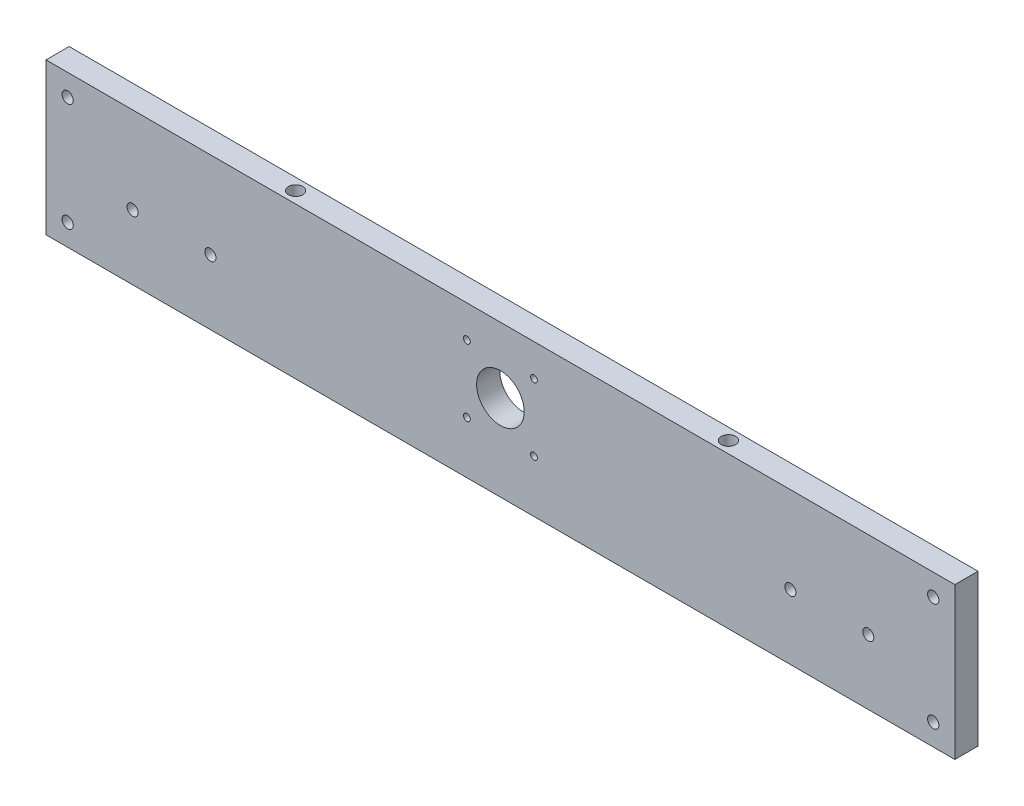
ISO-10303-21;
HEADER;
FILE_DESCRIPTION(('STEP AP214'),'2;1');
FILE_NAME('part.step','',(''),(''),'','','');
FILE_SCHEMA(('AUTOMOTIVE_DESIGN { 1 0 10303 214 1 1 1 1 }'));
ENDSEC;
DATA;
#1=APPLICATION_CONTEXT('core data for automotive mechanical design processes');
#2=APPLICATION_PROTOCOL_DEFINITION('international standard','automotive_design',2000,#1);
#3=PRODUCT_CONTEXT('',#1,'mechanical');
#4=PRODUCT('Part','Part','',(#3));
#5=PRODUCT_RELATED_PRODUCT_CATEGORY('part','',(#4));
#6=PRODUCT_DEFINITION_FORMATION('','',#4);
#7=PRODUCT_DEFINITION_CONTEXT('part definition',#1,'design');
#8=PRODUCT_DEFINITION('design','',#6,#7);
#9=PRODUCT_DEFINITION_SHAPE('','',#8);
#10=(LENGTH_UNIT() NAMED_UNIT(*) SI_UNIT(.MILLI.,.METRE.));
#11=(NAMED_UNIT(*) PLANE_ANGLE_UNIT() SI_UNIT($,.RADIAN.));
#12=(NAMED_UNIT(*) SI_UNIT($,.STERADIAN.) SOLID_ANGLE_UNIT());
#13=UNCERTAINTY_MEASURE_WITH_UNIT(LENGTH_MEASURE(1.E-05),#10,'distance_accuracy_value','');
#14=(GEOMETRIC_REPRESENTATION_CONTEXT(3) GLOBAL_UNCERTAINTY_ASSIGNED_CONTEXT((#13)) GLOBAL_UNIT_ASSIGNED_CONTEXT((#10,
#11,#12)) REPRESENTATION_CONTEXT('',''));
#15=CARTESIAN_POINT('',(0.,0.,0.));
#16=DIRECTION('',(0.,0.,1.));
#17=DIRECTION('',(1.,0.,0.));
#18=AXIS2_PLACEMENT_3D('',#15,#16,#17);
#19=CARTESIAN_POINT('',(-210.,-35.,10.7));
#20=DIRECTION('',(1.,0.,0.));
#21=DIRECTION('',(0.,0.,-1.));
#22=AXIS2_PLACEMENT_3D('',#19,#20,#21);
#23=PLANE('',#22);
#24=DIRECTION('',(0.,-1.,0.));
#25=VECTOR('',#24,1.);
#26=CARTESIAN_POINT('',(-210.,-35.,0.));
#27=LINE('',#26,#25);
#28=CARTESIAN_POINT('',(-210.,35.,0.));
#29=VERTEX_POINT('',#28);
#30=CARTESIAN_POINT('',(-210.,-35.,0.));
#31=VERTEX_POINT('',#30);
#32=EDGE_CURVE('E188',#29,#31,#27,.T.);
#33=ORIENTED_EDGE('',*,*,#32,.T.);
#34=DIRECTION('',(0.,0.,-1.));
#35=VECTOR('',#34,1.);
#36=CARTESIAN_POINT('',(-210.,-35.,10.7));
#37=LINE('',#36,#35);
#38=CARTESIAN_POINT('',(-210.,-35.,10.7));
#39=VERTEX_POINT('',#38);
#40=EDGE_CURVE('E11',#39,#31,#37,.T.);
#41=ORIENTED_EDGE('',*,*,#40,.F.);
#42=DIRECTION('',(0.,-1.,0.));
#43=VECTOR('',#42,1.);
#44=CARTESIAN_POINT('',(-210.,-35.,10.7));
#45=LINE('',#44,#43);
#46=CARTESIAN_POINT('',(-210.,35.,10.7));
#47=VERTEX_POINT('',#46);
#48=EDGE_CURVE('E191',#47,#39,#45,.T.);
#49=ORIENTED_EDGE('',*,*,#48,.F.);
#50=DIRECTION('',(0.,0.,-1.));
#51=VECTOR('',#50,1.);
#52=CARTESIAN_POINT('',(-210.,35.,10.7));
#53=LINE('',#52,#51);
#54=EDGE_CURVE('E197',#47,#29,#53,.T.);
#55=ORIENTED_EDGE('',*,*,#54,.T.);
#56=EDGE_LOOP('',(#33,#41,#49,#55));
#57=FACE_BOUND('',#56,.T.);
#58=ADVANCED_FACE('F37',(#57),#23,.F.);
#59=CARTESIAN_POINT('',(210.,-35.,10.7));
#60=DIRECTION('',(0.,1.,0.));
#61=DIRECTION('',(-1.,0.,0.));
#62=AXIS2_PLACEMENT_3D('',#59,#60,#61);
#63=PLANE('',#62);
#64=DIRECTION('',(1.,0.,0.));
#65=VECTOR('',#64,1.);
#66=CARTESIAN_POINT('',(210.,-35.,0.));
#67=LINE('',#66,#65);
#68=CARTESIAN_POINT('',(210.,-35.,0.));
#69=VERTEX_POINT('',#68);
#70=EDGE_CURVE('E200',#31,#69,#67,.T.);
#71=ORIENTED_EDGE('',*,*,#70,.T.);
#72=DIRECTION('',(0.,0.,-1.));
#73=VECTOR('',#72,1.);
#74=CARTESIAN_POINT('',(210.,-35.,10.7));
#75=LINE('',#74,#73);
#76=CARTESIAN_POINT('',(210.,-35.,10.7));
#77=VERTEX_POINT('',#76);
#78=EDGE_CURVE('E45',#77,#69,#75,.T.);
#79=ORIENTED_EDGE('',*,*,#78,.F.);
#80=DIRECTION('',(1.,0.,0.));
#81=VECTOR('',#80,1.);
#82=CARTESIAN_POINT('',(210.,-35.,10.7));
#83=LINE('',#82,#81);
#84=EDGE_CURVE('E84',#39,#77,#83,.T.);
#85=ORIENTED_EDGE('',*,*,#84,.F.);
#86=ORIENTED_EDGE('',*,*,#40,.T.);
#87=EDGE_LOOP('',(#71,#79,#85,#86));
#88=FACE_BOUND('',#87,.T.);
#89=ADVANCED_FACE('F225',(#88),#63,.F.);
#90=CARTESIAN_POINT('',(210.,-35.,10.7));
#91=DIRECTION('',(-1.,0.,0.));
#92=DIRECTION('',(0.,0.,1.));
#93=AXIS2_PLACEMENT_3D('',#90,#91,#92);
#94=PLANE('',#93);
#95=DIRECTION('',(0.,1.,0.));
#96=VECTOR('',#95,1.);
#97=CARTESIAN_POINT('',(210.,-35.,0.));
#98=LINE('',#97,#96);
#99=CARTESIAN_POINT('',(210.,35.,0.));
#100=VERTEX_POINT('',#99);
#101=EDGE_CURVE('E71',#69,#100,#98,.T.);
#102=ORIENTED_EDGE('',*,*,#101,.T.);
#103=DIRECTION('',(0.,0.,-1.));
#104=VECTOR('',#103,1.);
#105=CARTESIAN_POINT('',(210.,35.,10.7));
#106=LINE('',#105,#104);
#107=CARTESIAN_POINT('',(210.,35.,10.7));
#108=VERTEX_POINT('',#107);
#109=EDGE_CURVE('E205',#108,#100,#106,.T.);
#110=ORIENTED_EDGE('',*,*,#109,.F.);
#111=DIRECTION('',(0.,1.,0.));
#112=VECTOR('',#111,1.);
#113=CARTESIAN_POINT('',(210.,-35.,10.7));
#114=LINE('',#113,#112);
#115=EDGE_CURVE('E194',#77,#108,#114,.T.);
#116=ORIENTED_EDGE('',*,*,#115,.F.);
#117=ORIENTED_EDGE('',*,*,#78,.T.);
#118=EDGE_LOOP('',(#102,#110,#116,#117));
#119=FACE_BOUND('',#118,.T.);
#120=ADVANCED_FACE('F207',(#119),#94,.F.);
#121=CARTESIAN_POINT('',(210.,35.,10.7));
#122=DIRECTION('',(0.,-1.,0.));
#123=DIRECTION('',(1.,0.,0.));
#124=AXIS2_PLACEMENT_3D('',#121,#122,#123);
#125=PLANE('',#124);
#126=CARTESIAN_POINT('',(-100.,35.,5.35));
#127=DIRECTION('',(0.,1.,0.));
#128=DIRECTION('',(0.,0.,1.));
#129=AXIS2_PLACEMENT_3D('',#126,#127,#128);
#130=CIRCLE('',#129,3.31469999999999);
#131=CARTESIAN_POINT('',(-100.,35.,8.66469999999999));
#132=VERTEX_POINT('',#131);
#133=EDGE_CURVE('E102',#132,#132,#130,.T.);
#134=ORIENTED_EDGE('',*,*,#133,.F.);
#135=EDGE_LOOP('',(#134));
#136=FACE_BOUND('',#135,.T.);
#137=CARTESIAN_POINT('',(100.,35.,5.35));
#138=DIRECTION('',(0.,1.,0.));
#139=DIRECTION('',(0.,0.,1.));
#140=AXIS2_PLACEMENT_3D('',#137,#138,#139);
#141=CIRCLE('',#140,3.31469999999999);
#142=CARTESIAN_POINT('',(100.,35.,8.66469999999999));
#143=VERTEX_POINT('',#142);
#144=EDGE_CURVE('E101',#143,#143,#141,.T.);
#145=ORIENTED_EDGE('',*,*,#144,.F.);
#146=EDGE_LOOP('',(#145));
#147=FACE_BOUND('',#146,.T.);
#148=DIRECTION('',(-1.,0.,0.));
#149=VECTOR('',#148,1.);
#150=CARTESIAN_POINT('',(210.,35.,0.));
#151=LINE('',#150,#149);
#152=EDGE_CURVE('E77',#100,#29,#151,.T.);
#153=ORIENTED_EDGE('',*,*,#152,.T.);
#154=ORIENTED_EDGE('',*,*,#54,.F.);
#155=DIRECTION('',(-1.,0.,0.));
#156=VECTOR('',#155,1.);
#157=CARTESIAN_POINT('',(210.,35.,10.7));
#158=LINE('',#157,#156);
#159=EDGE_CURVE('E53',#108,#47,#158,.T.);
#160=ORIENTED_EDGE('',*,*,#159,.F.);
#161=ORIENTED_EDGE('',*,*,#109,.T.);
#162=EDGE_LOOP('',(#153,#154,#160,#161));
#163=FACE_BOUND('',#162,.T.);
#164=ADVANCED_FACE('F214',(#136,#147,#163),#125,.F.);
#165=CARTESIAN_POINT('',(0.,0.,10.7));
#166=DIRECTION('',(0.,0.,1.));
#167=DIRECTION('',(1.,0.,0.));
#168=AXIS2_PLACEMENT_3D('',#165,#166,#167);
#169=PLANE('',#168);
#170=CARTESIAN_POINT('',(-15.5,20.15,10.7));
#171=DIRECTION('',(0.,0.,1.));
#172=DIRECTION('',(1.,0.,0.));
#173=AXIS2_PLACEMENT_3D('',#170,#171,#172);
#174=CIRCLE('',#173,1.575);
#175=CARTESIAN_POINT('',(-13.925,20.15,10.7));
#176=VERTEX_POINT('',#175);
#177=EDGE_CURVE('E112',#176,#176,#174,.T.);
#178=ORIENTED_EDGE('',*,*,#177,.F.);
#179=EDGE_LOOP('',(#178));
#180=FACE_BOUND('',#179,.T.);
#181=CARTESIAN_POINT('',(-15.5,-10.85,10.7));
#182=DIRECTION('',(0.,0.,1.));
#183=DIRECTION('',(1.,0.,0.));
#184=AXIS2_PLACEMENT_3D('',#181,#182,#183);
#185=CIRCLE('',#184,1.575);
#186=CARTESIAN_POINT('',(-13.925,-10.85,10.7));
#187=VERTEX_POINT('',#186);
#188=EDGE_CURVE('E118',#187,#187,#185,.T.);
#189=ORIENTED_EDGE('',*,*,#188,.F.);
#190=EDGE_LOOP('',(#189));
#191=FACE_BOUND('',#190,.T.);
#192=CARTESIAN_POINT('',(15.5,-10.85,10.7));
#193=DIRECTION('',(0.,0.,1.));
#194=DIRECTION('',(1.,0.,0.));
#195=AXIS2_PLACEMENT_3D('',#192,#193,#194);
#196=CIRCLE('',#195,1.575);
#197=CARTESIAN_POINT('',(17.075,-10.85,10.7));
#198=VERTEX_POINT('',#197);
#199=EDGE_CURVE('E124',#198,#198,#196,.T.);
#200=ORIENTED_EDGE('',*,*,#199,.F.);
#201=EDGE_LOOP('',(#200));
#202=FACE_BOUND('',#201,.T.);
#203=CARTESIAN_POINT('',(15.5,20.15,10.7));
#204=DIRECTION('',(0.,0.,1.));
#205=DIRECTION('',(1.,0.,0.));
#206=AXIS2_PLACEMENT_3D('',#203,#204,#205);
#207=CIRCLE('',#206,1.575);
#208=CARTESIAN_POINT('',(17.075,20.15,10.7));
#209=VERTEX_POINT('',#208);
#210=EDGE_CURVE('E130',#209,#209,#207,.T.);
#211=ORIENTED_EDGE('',*,*,#210,.F.);
#212=EDGE_LOOP('',(#211));
#213=FACE_BOUND('',#212,.T.);
#214=CARTESIAN_POINT('',(-200.,25.,10.7));
#215=DIRECTION('',(0.,0.,1.));
#216=DIRECTION('',(1.,0.,0.));
#217=AXIS2_PLACEMENT_3D('',#214,#215,#216);
#218=CIRCLE('',#217,2.59999999999999);
#219=CARTESIAN_POINT('',(-197.4,25.,10.7));
#220=VERTEX_POINT('',#219);
#221=EDGE_CURVE('E136',#220,#220,#218,.T.);
#222=ORIENTED_EDGE('',*,*,#221,.F.);
#223=EDGE_LOOP('',(#222));
#224=FACE_BOUND('',#223,.T.);
#225=CARTESIAN_POINT('',(-200.,-25.,10.7));
#226=DIRECTION('',(0.,0.,1.));
#227=DIRECTION('',(1.,0.,0.));
#228=AXIS2_PLACEMENT_3D('',#225,#226,#227);
#229=CIRCLE('',#228,2.59999999999999);
#230=CARTESIAN_POINT('',(-197.4,-25.,10.7));
#231=VERTEX_POINT('',#230);
#232=EDGE_CURVE('E142',#231,#231,#229,.T.);
#233=ORIENTED_EDGE('',*,*,#232,.F.);
#234=EDGE_LOOP('',(#233));
#235=FACE_BOUND('',#234,.T.);
#236=CARTESIAN_POINT('',(200.,-25.,10.7));
#237=DIRECTION('',(0.,0.,1.));
#238=DIRECTION('',(1.,0.,0.));
#239=AXIS2_PLACEMENT_3D('',#236,#237,#238);
#240=CIRCLE('',#239,2.59999999999999);
#241=CARTESIAN_POINT('',(202.6,-25.,10.7));
#242=VERTEX_POINT('',#241);
#243=EDGE_CURVE('E148',#242,#242,#240,.T.);
#244=ORIENTED_EDGE('',*,*,#243,.F.);
#245=EDGE_LOOP('',(#244));
#246=FACE_BOUND('',#245,.T.);
#247=CARTESIAN_POINT('',(200.,25.,10.7));
#248=DIRECTION('',(0.,0.,1.));
#249=DIRECTION('',(1.,0.,0.));
#250=AXIS2_PLACEMENT_3D('',#247,#248,#249);
#251=CIRCLE('',#250,2.59999999999999);
#252=CARTESIAN_POINT('',(202.6,25.,10.7));
#253=VERTEX_POINT('',#252);
#254=EDGE_CURVE('E154',#253,#253,#251,.T.);
#255=ORIENTED_EDGE('',*,*,#254,.F.);
#256=EDGE_LOOP('',(#255));
#257=FACE_BOUND('',#256,.T.);
#258=CARTESIAN_POINT('',(-170.,-5.00000000000003,10.7));
#259=DIRECTION('',(0.,0.,1.));
#260=DIRECTION('',(1.,0.,0.));
#261=AXIS2_PLACEMENT_3D('',#258,#259,#260);
#262=CIRCLE('',#261,2.55269999999999);
#263=CARTESIAN_POINT('',(-167.4473,-5.00000000000003,10.7));
#264=VERTEX_POINT('',#263);
#265=EDGE_CURVE('E160',#264,#264,#262,.T.);
#266=ORIENTED_EDGE('',*,*,#265,.F.);
#267=EDGE_LOOP('',(#266));
#268=FACE_BOUND('',#267,.T.);
#269=CARTESIAN_POINT('',(-134.,-5.00000000000003,10.7));
#270=DIRECTION('',(0.,0.,1.));
#271=DIRECTION('',(1.,0.,0.));
#272=AXIS2_PLACEMENT_3D('',#269,#270,#271);
#273=CIRCLE('',#272,2.55269999999999);
#274=CARTESIAN_POINT('',(-131.4473,-5.00000000000003,10.7));
#275=VERTEX_POINT('',#274);
#276=EDGE_CURVE('E166',#275,#275,#273,.T.);
#277=ORIENTED_EDGE('',*,*,#276,.F.);
#278=EDGE_LOOP('',(#277));
#279=FACE_BOUND('',#278,.T.);
#280=CARTESIAN_POINT('',(134.,-5.00000000000003,10.7));
#281=DIRECTION('',(0.,0.,1.));
#282=DIRECTION('',(1.,0.,0.));
#283=AXIS2_PLACEMENT_3D('',#280,#281,#282);
#284=CIRCLE('',#283,2.55269999999999);
#285=CARTESIAN_POINT('',(136.5527,-5.00000000000003,10.7));
#286=VERTEX_POINT('',#285);
#287=EDGE_CURVE('E172',#286,#286,#284,.T.);
#288=ORIENTED_EDGE('',*,*,#287,.F.);
#289=EDGE_LOOP('',(#288));
#290=FACE_BOUND('',#289,.T.);
#291=CARTESIAN_POINT('',(170.,-5.00000000000003,10.7));
#292=DIRECTION('',(0.,0.,1.));
#293=DIRECTION('',(1.,0.,0.));
#294=AXIS2_PLACEMENT_3D('',#291,#292,#293);
#295=CIRCLE('',#294,2.55269999999999);
#296=CARTESIAN_POINT('',(172.5527,-5.00000000000003,10.7));
#297=VERTEX_POINT('',#296);
#298=EDGE_CURVE('E178',#297,#297,#295,.T.);
#299=ORIENTED_EDGE('',*,*,#298,.F.);
#300=EDGE_LOOP('',(#299));
#301=FACE_BOUND('',#300,.T.);
#302=CARTESIAN_POINT('',(0.,4.64999999999997,10.7));
#303=DIRECTION('',(0.,0.,1.));
#304=DIRECTION('',(1.,0.,0.));
#305=AXIS2_PLACEMENT_3D('',#302,#303,#304);
#306=CIRCLE('',#305,11.);
#307=CARTESIAN_POINT('',(11.,4.64999999999997,10.7));
#308=VERTEX_POINT('',#307);
#309=EDGE_CURVE('E184',#308,#308,#306,.T.);
#310=ORIENTED_EDGE('',*,*,#309,.F.);
#311=EDGE_LOOP('',(#310));
#312=FACE_BOUND('',#311,.T.);
#313=ORIENTED_EDGE('',*,*,#48,.T.);
#314=ORIENTED_EDGE('',*,*,#84,.T.);
#315=ORIENTED_EDGE('',*,*,#115,.T.);
#316=ORIENTED_EDGE('',*,*,#159,.T.);
#317=EDGE_LOOP('',(#313,#314,#315,#316));
#318=FACE_BOUND('',#317,.T.);
#319=ADVANCED_FACE('F216',(#180,#191,#202,#213,#224,#235,#246,#257,#268,#279,#290,#301,#312,
#318),#169,.T.);
#320=CARTESIAN_POINT('',(0.,0.,0.));
#321=DIRECTION('',(0.,0.,1.));
#322=DIRECTION('',(1.,0.,0.));
#323=AXIS2_PLACEMENT_3D('',#320,#321,#322);
#324=PLANE('',#323);
#325=CARTESIAN_POINT('',(-15.5,20.15,0.));
#326=DIRECTION('',(0.,0.,1.));
#327=DIRECTION('',(1.,0.,0.));
#328=AXIS2_PLACEMENT_3D('',#325,#326,#327);
#329=CIRCLE('',#328,1.575);
#330=CARTESIAN_POINT('',(-13.925,20.15,0.));
#331=VERTEX_POINT('',#330);
#332=EDGE_CURVE('E115',#331,#331,#329,.T.);
#333=ORIENTED_EDGE('',*,*,#332,.T.);
#334=EDGE_LOOP('',(#333));
#335=FACE_BOUND('',#334,.T.);
#336=CARTESIAN_POINT('',(-15.5,-10.85,0.));
#337=DIRECTION('',(0.,0.,1.));
#338=DIRECTION('',(1.,0.,0.));
#339=AXIS2_PLACEMENT_3D('',#336,#337,#338);
#340=CIRCLE('',#339,1.575);
#341=CARTESIAN_POINT('',(-13.925,-10.85,0.));
#342=VERTEX_POINT('',#341);
#343=EDGE_CURVE('E121',#342,#342,#340,.T.);
#344=ORIENTED_EDGE('',*,*,#343,.T.);
#345=EDGE_LOOP('',(#344));
#346=FACE_BOUND('',#345,.T.);
#347=CARTESIAN_POINT('',(15.5,-10.85,0.));
#348=DIRECTION('',(0.,0.,1.));
#349=DIRECTION('',(1.,0.,0.));
#350=AXIS2_PLACEMENT_3D('',#347,#348,#349);
#351=CIRCLE('',#350,1.575);
#352=CARTESIAN_POINT('',(17.075,-10.85,0.));
#353=VERTEX_POINT('',#352);
#354=EDGE_CURVE('E127',#353,#353,#351,.T.);
#355=ORIENTED_EDGE('',*,*,#354,.T.);
#356=EDGE_LOOP('',(#355));
#357=FACE_BOUND('',#356,.T.);
#358=CARTESIAN_POINT('',(15.5,20.15,0.));
#359=DIRECTION('',(0.,0.,1.));
#360=DIRECTION('',(1.,0.,0.));
#361=AXIS2_PLACEMENT_3D('',#358,#359,#360);
#362=CIRCLE('',#361,1.575);
#363=CARTESIAN_POINT('',(17.075,20.15,0.));
#364=VERTEX_POINT('',#363);
#365=EDGE_CURVE('E133',#364,#364,#362,.T.);
#366=ORIENTED_EDGE('',*,*,#365,.T.);
#367=EDGE_LOOP('',(#366));
#368=FACE_BOUND('',#367,.T.);
#369=CARTESIAN_POINT('',(-200.,25.,0.));
#370=DIRECTION('',(0.,0.,1.));
#371=DIRECTION('',(1.,0.,0.));
#372=AXIS2_PLACEMENT_3D('',#369,#370,#371);
#373=CIRCLE('',#372,2.59999999999999);
#374=CARTESIAN_POINT('',(-197.4,25.,0.));
#375=VERTEX_POINT('',#374);
#376=EDGE_CURVE('E139',#375,#375,#373,.T.);
#377=ORIENTED_EDGE('',*,*,#376,.T.);
#378=EDGE_LOOP('',(#377));
#379=FACE_BOUND('',#378,.T.);
#380=CARTESIAN_POINT('',(-200.,-25.,0.));
#381=DIRECTION('',(0.,0.,1.));
#382=DIRECTION('',(1.,0.,0.));
#383=AXIS2_PLACEMENT_3D('',#380,#381,#382);
#384=CIRCLE('',#383,2.59999999999999);
#385=CARTESIAN_POINT('',(-197.4,-25.,0.));
#386=VERTEX_POINT('',#385);
#387=EDGE_CURVE('E145',#386,#386,#384,.T.);
#388=ORIENTED_EDGE('',*,*,#387,.T.);
#389=EDGE_LOOP('',(#388));
#390=FACE_BOUND('',#389,.T.);
#391=CARTESIAN_POINT('',(200.,-25.,0.));
#392=DIRECTION('',(0.,0.,1.));
#393=DIRECTION('',(1.,0.,0.));
#394=AXIS2_PLACEMENT_3D('',#391,#392,#393);
#395=CIRCLE('',#394,2.59999999999999);
#396=CARTESIAN_POINT('',(202.6,-25.,0.));
#397=VERTEX_POINT('',#396);
#398=EDGE_CURVE('E151',#397,#397,#395,.T.);
#399=ORIENTED_EDGE('',*,*,#398,.T.);
#400=EDGE_LOOP('',(#399));
#401=FACE_BOUND('',#400,.T.);
#402=CARTESIAN_POINT('',(200.,25.,0.));
#403=DIRECTION('',(0.,0.,1.));
#404=DIRECTION('',(1.,0.,0.));
#405=AXIS2_PLACEMENT_3D('',#402,#403,#404);
#406=CIRCLE('',#405,2.59999999999999);
#407=CARTESIAN_POINT('',(202.6,25.,0.));
#408=VERTEX_POINT('',#407);
#409=EDGE_CURVE('E157',#408,#408,#406,.T.);
#410=ORIENTED_EDGE('',*,*,#409,.T.);
#411=EDGE_LOOP('',(#410));
#412=FACE_BOUND('',#411,.T.);
#413=CARTESIAN_POINT('',(-170.,-5.00000000000003,0.));
#414=DIRECTION('',(0.,0.,1.));
#415=DIRECTION('',(1.,0.,0.));
#416=AXIS2_PLACEMENT_3D('',#413,#414,#415);
#417=CIRCLE('',#416,2.55269999999999);
#418=CARTESIAN_POINT('',(-167.4473,-5.00000000000003,0.));
#419=VERTEX_POINT('',#418);
#420=EDGE_CURVE('E163',#419,#419,#417,.T.);
#421=ORIENTED_EDGE('',*,*,#420,.T.);
#422=EDGE_LOOP('',(#421));
#423=FACE_BOUND('',#422,.T.);
#424=CARTESIAN_POINT('',(-134.,-5.00000000000003,0.));
#425=DIRECTION('',(0.,0.,1.));
#426=DIRECTION('',(1.,0.,0.));
#427=AXIS2_PLACEMENT_3D('',#424,#425,#426);
#428=CIRCLE('',#427,2.55269999999999);
#429=CARTESIAN_POINT('',(-131.4473,-5.00000000000003,0.));
#430=VERTEX_POINT('',#429);
#431=EDGE_CURVE('E169',#430,#430,#428,.T.);
#432=ORIENTED_EDGE('',*,*,#431,.T.);
#433=EDGE_LOOP('',(#432));
#434=FACE_BOUND('',#433,.T.);
#435=CARTESIAN_POINT('',(134.,-5.00000000000003,0.));
#436=DIRECTION('',(0.,0.,1.));
#437=DIRECTION('',(1.,0.,0.));
#438=AXIS2_PLACEMENT_3D('',#435,#436,#437);
#439=CIRCLE('',#438,2.55269999999999);
#440=CARTESIAN_POINT('',(136.5527,-5.00000000000003,0.));
#441=VERTEX_POINT('',#440);
#442=EDGE_CURVE('E175',#441,#441,#439,.T.);
#443=ORIENTED_EDGE('',*,*,#442,.T.);
#444=EDGE_LOOP('',(#443));
#445=FACE_BOUND('',#444,.T.);
#446=CARTESIAN_POINT('',(170.,-5.00000000000003,0.));
#447=DIRECTION('',(0.,0.,1.));
#448=DIRECTION('',(1.,0.,0.));
#449=AXIS2_PLACEMENT_3D('',#446,#447,#448);
#450=CIRCLE('',#449,2.55269999999999);
#451=CARTESIAN_POINT('',(172.5527,-5.00000000000003,0.));
#452=VERTEX_POINT('',#451);
#453=EDGE_CURVE('E181',#452,#452,#450,.T.);
#454=ORIENTED_EDGE('',*,*,#453,.T.);
#455=EDGE_LOOP('',(#454));
#456=FACE_BOUND('',#455,.T.);
#457=CARTESIAN_POINT('',(0.,4.64999999999997,0.));
#458=DIRECTION('',(0.,0.,1.));
#459=DIRECTION('',(1.,0.,0.));
#460=AXIS2_PLACEMENT_3D('',#457,#458,#459);
#461=CIRCLE('',#460,11.);
#462=CARTESIAN_POINT('',(11.,4.64999999999997,0.));
#463=VERTEX_POINT('',#462);
#464=EDGE_CURVE('E185',#463,#463,#461,.T.);
#465=ORIENTED_EDGE('',*,*,#464,.T.);
#466=EDGE_LOOP('',(#465));
#467=FACE_BOUND('',#466,.T.);
#468=ORIENTED_EDGE('',*,*,#32,.F.);
#469=ORIENTED_EDGE('',*,*,#152,.F.);
#470=ORIENTED_EDGE('',*,*,#101,.F.);
#471=ORIENTED_EDGE('',*,*,#70,.F.);
#472=EDGE_LOOP('',(#468,#469,#470,#471));
#473=FACE_BOUND('',#472,.T.);
#474=ADVANCED_FACE('F210',(#335,#346,#357,#368,#379,#390,#401,#412,#423,#434,#445,#456,#467,
#473),#324,.F.);
#475=CARTESIAN_POINT('',(0.,4.64999999999997,0.));
#476=DIRECTION('',(0.,0.,1.));
#477=DIRECTION('',(1.,0.,0.));
#478=AXIS2_PLACEMENT_3D('',#475,#476,#477);
#479=CYLINDRICAL_SURFACE('',#478,11.);
#480=ORIENTED_EDGE('',*,*,#464,.F.);
#481=EDGE_LOOP('',(#480));
#482=FACE_BOUND('',#481,.T.);
#483=ORIENTED_EDGE('',*,*,#309,.T.);
#484=EDGE_LOOP('',(#483));
#485=FACE_BOUND('',#484,.T.);
#486=ADVANCED_FACE('F246',(#482,#485),#479,.F.);
#487=CARTESIAN_POINT('',(170.,-5.00000000000003,10.7));
#488=DIRECTION('',(0.,0.,1.));
#489=DIRECTION('',(1.,0.,0.));
#490=AXIS2_PLACEMENT_3D('',#487,#488,#489);
#491=CYLINDRICAL_SURFACE('',#490,2.55269999999999);
#492=ORIENTED_EDGE('',*,*,#453,.F.);
#493=EDGE_LOOP('',(#492));
#494=FACE_BOUND('',#493,.T.);
#495=ORIENTED_EDGE('',*,*,#298,.T.);
#496=EDGE_LOOP('',(#495));
#497=FACE_BOUND('',#496,.T.);
#498=ADVANCED_FACE('F251',(#494,#497),#491,.F.);
#499=CARTESIAN_POINT('',(134.,-5.00000000000003,10.7));
#500=DIRECTION('',(0.,0.,1.));
#501=DIRECTION('',(1.,0.,0.));
#502=AXIS2_PLACEMENT_3D('',#499,#500,#501);
#503=CYLINDRICAL_SURFACE('',#502,2.55269999999999);
#504=ORIENTED_EDGE('',*,*,#442,.F.);
#505=EDGE_LOOP('',(#504));
#506=FACE_BOUND('',#505,.T.);
#507=ORIENTED_EDGE('',*,*,#287,.T.);
#508=EDGE_LOOP('',(#507));
#509=FACE_BOUND('',#508,.T.);
#510=ADVANCED_FACE('F264',(#506,#509),#503,.F.);
#511=CARTESIAN_POINT('',(-134.,-5.00000000000003,10.7));
#512=DIRECTION('',(0.,0.,1.));
#513=DIRECTION('',(1.,0.,0.));
#514=AXIS2_PLACEMENT_3D('',#511,#512,#513);
#515=CYLINDRICAL_SURFACE('',#514,2.55269999999999);
#516=ORIENTED_EDGE('',*,*,#431,.F.);
#517=EDGE_LOOP('',(#516));
#518=FACE_BOUND('',#517,.T.);
#519=ORIENTED_EDGE('',*,*,#276,.T.);
#520=EDGE_LOOP('',(#519));
#521=FACE_BOUND('',#520,.T.);
#522=ADVANCED_FACE('F277',(#518,#521),#515,.F.);
#523=CARTESIAN_POINT('',(-170.,-5.00000000000003,10.7));
#524=DIRECTION('',(0.,0.,1.));
#525=DIRECTION('',(1.,0.,0.));
#526=AXIS2_PLACEMENT_3D('',#523,#524,#525);
#527=CYLINDRICAL_SURFACE('',#526,2.55269999999999);
#528=ORIENTED_EDGE('',*,*,#420,.F.);
#529=EDGE_LOOP('',(#528));
#530=FACE_BOUND('',#529,.T.);
#531=ORIENTED_EDGE('',*,*,#265,.T.);
#532=EDGE_LOOP('',(#531));
#533=FACE_BOUND('',#532,.T.);
#534=ADVANCED_FACE('F291',(#530,#533),#527,.F.);
#535=CARTESIAN_POINT('',(200.,25.,10.7));
#536=DIRECTION('',(0.,0.,1.));
#537=DIRECTION('',(1.,0.,0.));
#538=AXIS2_PLACEMENT_3D('',#535,#536,#537);
#539=CYLINDRICAL_SURFACE('',#538,2.59999999999999);
#540=ORIENTED_EDGE('',*,*,#409,.F.);
#541=EDGE_LOOP('',(#540));
#542=FACE_BOUND('',#541,.T.);
#543=ORIENTED_EDGE('',*,*,#254,.T.);
#544=EDGE_LOOP('',(#543));
#545=FACE_BOUND('',#544,.T.);
#546=ADVANCED_FACE('F305',(#542,#545),#539,.F.);
#547=CARTESIAN_POINT('',(200.,-25.,10.7));
#548=DIRECTION('',(0.,0.,1.));
#549=DIRECTION('',(1.,0.,0.));
#550=AXIS2_PLACEMENT_3D('',#547,#548,#549);
#551=CYLINDRICAL_SURFACE('',#550,2.59999999999999);
#552=ORIENTED_EDGE('',*,*,#398,.F.);
#553=EDGE_LOOP('',(#552));
#554=FACE_BOUND('',#553,.T.);
#555=ORIENTED_EDGE('',*,*,#243,.T.);
#556=EDGE_LOOP('',(#555));
#557=FACE_BOUND('',#556,.T.);
#558=ADVANCED_FACE('F319',(#554,#557),#551,.F.);
#559=CARTESIAN_POINT('',(-200.,-25.,10.7));
#560=DIRECTION('',(0.,0.,1.));
#561=DIRECTION('',(1.,0.,0.));
#562=AXIS2_PLACEMENT_3D('',#559,#560,#561);
#563=CYLINDRICAL_SURFACE('',#562,2.59999999999999);
#564=ORIENTED_EDGE('',*,*,#387,.F.);
#565=EDGE_LOOP('',(#564));
#566=FACE_BOUND('',#565,.T.);
#567=ORIENTED_EDGE('',*,*,#232,.T.);
#568=EDGE_LOOP('',(#567));
#569=FACE_BOUND('',#568,.T.);
#570=ADVANCED_FACE('F333',(#566,#569),#563,.F.);
#571=CARTESIAN_POINT('',(-200.,25.,10.7));
#572=DIRECTION('',(0.,0.,1.));
#573=DIRECTION('',(1.,0.,0.));
#574=AXIS2_PLACEMENT_3D('',#571,#572,#573);
#575=CYLINDRICAL_SURFACE('',#574,2.59999999999999);
#576=ORIENTED_EDGE('',*,*,#376,.F.);
#577=EDGE_LOOP('',(#576));
#578=FACE_BOUND('',#577,.T.);
#579=ORIENTED_EDGE('',*,*,#221,.T.);
#580=EDGE_LOOP('',(#579));
#581=FACE_BOUND('',#580,.T.);
#582=ADVANCED_FACE('F347',(#578,#581),#575,.F.);
#583=CARTESIAN_POINT('',(15.5,20.15,10.7));
#584=DIRECTION('',(0.,0.,1.));
#585=DIRECTION('',(1.,0.,0.));
#586=AXIS2_PLACEMENT_3D('',#583,#584,#585);
#587=CYLINDRICAL_SURFACE('',#586,1.575);
#588=ORIENTED_EDGE('',*,*,#365,.F.);
#589=EDGE_LOOP('',(#588));
#590=FACE_BOUND('',#589,.T.);
#591=ORIENTED_EDGE('',*,*,#210,.T.);
#592=EDGE_LOOP('',(#591));
#593=FACE_BOUND('',#592,.T.);
#594=ADVANCED_FACE('F361',(#590,#593),#587,.F.);
#595=CARTESIAN_POINT('',(15.5,-10.85,10.7));
#596=DIRECTION('',(0.,0.,1.));
#597=DIRECTION('',(1.,0.,0.));
#598=AXIS2_PLACEMENT_3D('',#595,#596,#597);
#599=CYLINDRICAL_SURFACE('',#598,1.575);
#600=ORIENTED_EDGE('',*,*,#354,.F.);
#601=EDGE_LOOP('',(#600));
#602=FACE_BOUND('',#601,.T.);
#603=ORIENTED_EDGE('',*,*,#199,.T.);
#604=EDGE_LOOP('',(#603));
#605=FACE_BOUND('',#604,.T.);
#606=ADVANCED_FACE('F390',(#602,#605),#599,.F.);
#607=CARTESIAN_POINT('',(-15.5,-10.85,10.7));
#608=DIRECTION('',(0.,0.,1.));
#609=DIRECTION('',(1.,0.,0.));
#610=AXIS2_PLACEMENT_3D('',#607,#608,#609);
#611=CYLINDRICAL_SURFACE('',#610,1.575);
#612=ORIENTED_EDGE('',*,*,#343,.F.);
#613=EDGE_LOOP('',(#612));
#614=FACE_BOUND('',#613,.T.);
#615=ORIENTED_EDGE('',*,*,#188,.T.);
#616=EDGE_LOOP('',(#615));
#617=FACE_BOUND('',#616,.T.);
#618=ADVANCED_FACE('F403',(#614,#617),#611,.F.);
#619=CARTESIAN_POINT('',(-15.5,20.15,10.7));
#620=DIRECTION('',(0.,0.,1.));
#621=DIRECTION('',(1.,0.,0.));
#622=AXIS2_PLACEMENT_3D('',#619,#620,#621);
#623=CYLINDRICAL_SURFACE('',#622,1.575);
#624=ORIENTED_EDGE('',*,*,#332,.F.);
#625=EDGE_LOOP('',(#624));
#626=FACE_BOUND('',#625,.T.);
#627=ORIENTED_EDGE('',*,*,#177,.T.);
#628=EDGE_LOOP('',(#627));
#629=FACE_BOUND('',#628,.T.);
#630=ADVANCED_FACE('F416',(#626,#629),#623,.F.);
#631=CARTESIAN_POINT('',(100.,20.,5.35));
#632=DIRECTION('',(0.,1.,0.));
#633=DIRECTION('',(0.,0.,1.));
#634=AXIS2_PLACEMENT_3D('',#631,#632,#633);
#635=CONICAL_SURFACE('',#634,3.31469999999999,1.02974425867665);
#636=CARTESIAN_POINT('',(100.,18.0083273061094,5.35));
#637=VERTEX_POINT('',#636);
#638=VERTEX_LOOP('',#637);
#639=FACE_BOUND('',#638,.T.);
#640=CARTESIAN_POINT('',(100.,20.,5.35));
#641=DIRECTION('',(0.,1.,0.));
#642=DIRECTION('',(0.,0.,1.));
#643=AXIS2_PLACEMENT_3D('',#640,#641,#642);
#644=CIRCLE('',#643,3.31469999999999);
#645=CARTESIAN_POINT('',(100.,20.,8.66469999999999));
#646=VERTEX_POINT('',#645);
#647=EDGE_CURVE('E105',#646,#646,#644,.T.);
#648=ORIENTED_EDGE('',*,*,#647,.T.);
#649=EDGE_LOOP('',(#648));
#650=FACE_BOUND('',#649,.T.);
#651=ADVANCED_FACE('F430',(#639,#650),#635,.F.);
#652=CARTESIAN_POINT('',(100.,35.,5.35));
#653=DIRECTION('',(0.,1.,0.));
#654=DIRECTION('',(0.,0.,1.));
#655=AXIS2_PLACEMENT_3D('',#652,#653,#654);
#656=CYLINDRICAL_SURFACE('',#655,3.31469999999999);
#657=ORIENTED_EDGE('',*,*,#647,.F.);
#658=EDGE_LOOP('',(#657));
#659=FACE_BOUND('',#658,.T.);
#660=ORIENTED_EDGE('',*,*,#144,.T.);
#661=EDGE_LOOP('',(#660));
#662=FACE_BOUND('',#661,.T.);
#663=ADVANCED_FACE('F95',(#659,#662),#656,.F.);
#664=CARTESIAN_POINT('',(-100.,20.,5.35));
#665=DIRECTION('',(0.,1.,0.));
#666=DIRECTION('',(0.,0.,1.));
#667=AXIS2_PLACEMENT_3D('',#664,#665,#666);
#668=CONICAL_SURFACE('',#667,3.31469999999999,1.02974425867665);
#669=CARTESIAN_POINT('',(-100.,18.0083273061093,5.35));
#670=VERTEX_POINT('',#669);
#671=VERTEX_LOOP('',#670);
#672=FACE_BOUND('',#671,.T.);
#673=CARTESIAN_POINT('',(-100.,20.,5.35));
#674=DIRECTION('',(0.,1.,0.));
#675=DIRECTION('',(0.,0.,1.));
#676=AXIS2_PLACEMENT_3D('',#673,#674,#675);
#677=CIRCLE('',#676,3.31469999999999);
#678=CARTESIAN_POINT('',(-100.,20.,8.66469999999999));
#679=VERTEX_POINT('',#678);
#680=EDGE_CURVE('E99',#679,#679,#677,.T.);
#681=ORIENTED_EDGE('',*,*,#680,.T.);
#682=EDGE_LOOP('',(#681));
#683=FACE_BOUND('',#682,.T.);
#684=ADVANCED_FACE('F91',(#672,#683),#668,.F.);
#685=CARTESIAN_POINT('',(-100.,35.,5.35));
#686=DIRECTION('',(0.,1.,0.));
#687=DIRECTION('',(0.,0.,1.));
#688=AXIS2_PLACEMENT_3D('',#685,#686,#687);
#689=CYLINDRICAL_SURFACE('',#688,3.31469999999999);
#690=ORIENTED_EDGE('',*,*,#680,.F.);
#691=EDGE_LOOP('',(#690));
#692=FACE_BOUND('',#691,.T.);
#693=ORIENTED_EDGE('',*,*,#133,.T.);
#694=EDGE_LOOP('',(#693));
#695=FACE_BOUND('',#694,.T.);
#696=ADVANCED_FACE('F94',(#692,#695),#689,.F.);
#697=CLOSED_SHELL('',(#58,#89,#120,#164,#319,#474,#486,#498,#510,#522,#534,#546,#558,#570,#582,
#594,#606,#618,#630,#651,#663,#684,#696));
#698=MANIFOLD_SOLID_BREP('B2',#697);
#699=ADVANCED_BREP_SHAPE_REPRESENTATION('',(#18,#698),#14);
#700=SHAPE_DEFINITION_REPRESENTATION(#9,#699);
ENDSEC;
END-ISO-10303-21;
